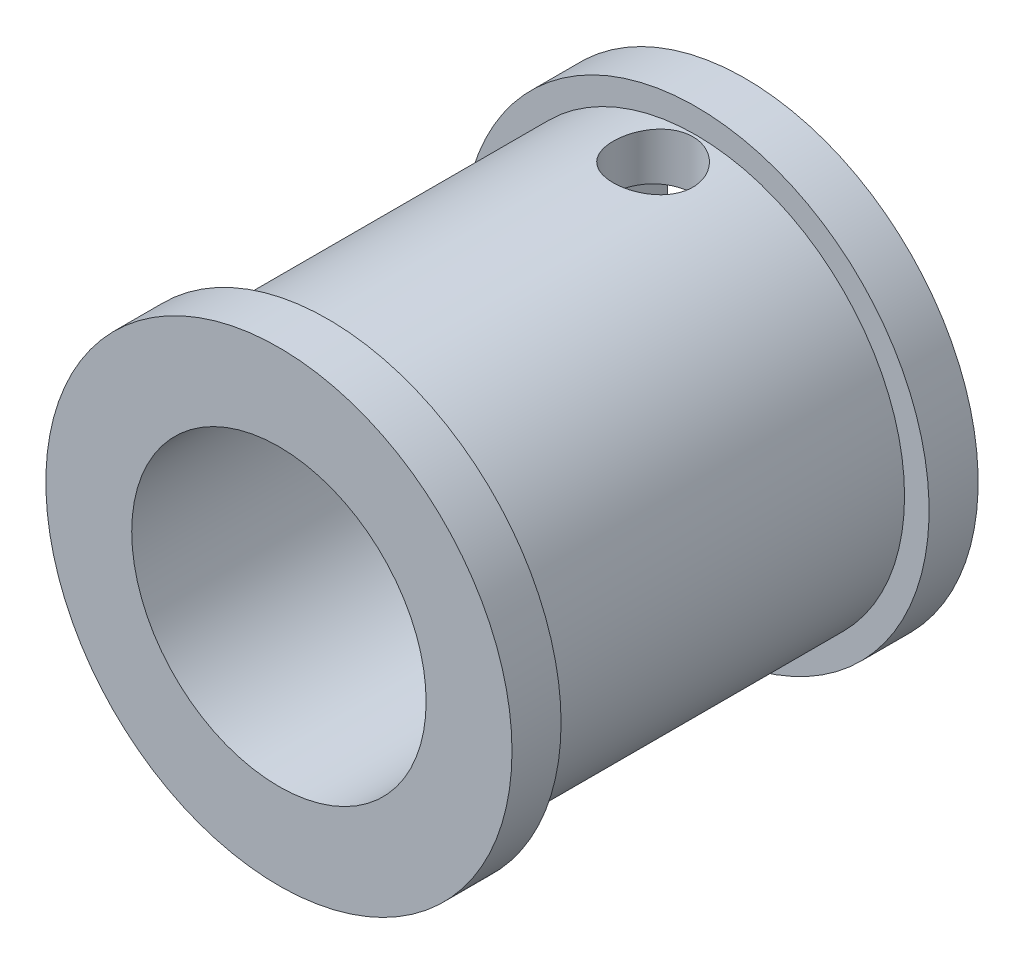
ISO-10303-21;
HEADER;
FILE_DESCRIPTION(('STEP AP214'),'2;1');
FILE_NAME('part.step','',(''),(''),'','','');
FILE_SCHEMA(('AUTOMOTIVE_DESIGN { 1 0 10303 214 1 1 1 1 }'));
ENDSEC;
DATA;
#1=APPLICATION_CONTEXT('core data for automotive mechanical design processes');
#2=APPLICATION_PROTOCOL_DEFINITION('international standard','automotive_design',2000,#1);
#3=PRODUCT_CONTEXT('',#1,'mechanical');
#4=PRODUCT('Part','Part','',(#3));
#5=PRODUCT_RELATED_PRODUCT_CATEGORY('part','',(#4));
#6=PRODUCT_DEFINITION_FORMATION('','',#4);
#7=PRODUCT_DEFINITION_CONTEXT('part definition',#1,'design');
#8=PRODUCT_DEFINITION('design','',#6,#7);
#9=PRODUCT_DEFINITION_SHAPE('','',#8);
#10=(LENGTH_UNIT() NAMED_UNIT(*) SI_UNIT(.MILLI.,.METRE.));
#11=(NAMED_UNIT(*) PLANE_ANGLE_UNIT() SI_UNIT($,.RADIAN.));
#12=(NAMED_UNIT(*) SI_UNIT($,.STERADIAN.) SOLID_ANGLE_UNIT());
#13=UNCERTAINTY_MEASURE_WITH_UNIT(LENGTH_MEASURE(1.E-05),#10,'distance_accuracy_value','');
#14=(GEOMETRIC_REPRESENTATION_CONTEXT(3) GLOBAL_UNCERTAINTY_ASSIGNED_CONTEXT((#13)) GLOBAL_UNIT_ASSIGNED_CONTEXT((#10,
#11,#12)) REPRESENTATION_CONTEXT('',''));
#15=CARTESIAN_POINT('',(0.,0.,0.));
#16=DIRECTION('',(0.,0.,1.));
#17=DIRECTION('',(1.,0.,0.));
#18=AXIS2_PLACEMENT_3D('',#15,#16,#17);
#19=CARTESIAN_POINT('',(0.,0.,19.));
#20=DIRECTION('',(0.,0.,-1.));
#21=DIRECTION('',(-1.,0.,0.));
#22=AXIS2_PLACEMENT_3D('',#19,#20,#21);
#23=CYLINDRICAL_SURFACE('',#22,1.625);
#24=CARTESIAN_POINT('',(0.,0.,3.75));
#25=DIRECTION('',(0.,-0.707106781186547,-0.707106781186547));
#26=DIRECTION('',(0.,0.707106781186547,-0.707106781186547));
#27=AXIS2_PLACEMENT_3D('',#24,#25,#26);
#28=ELLIPSE('',#27,2.29809703885628,1.625);
#29=CARTESIAN_POINT('',(-1.625,0.,3.75));
#30=VERTEX_POINT('',#29);
#31=CARTESIAN_POINT('',(-1.61264534228701,-0.2,3.95));
#32=VERTEX_POINT('',#31);
#33=EDGE_CURVE('E113',#30,#32,#28,.F.);
#34=ORIENTED_EDGE('',*,*,#33,.F.);
#35=CARTESIAN_POINT('',(0.,0.,3.75));
#36=DIRECTION('',(0.,0.707106781186547,-0.707106781186547));
#37=DIRECTION('',(0.,-0.707106781186547,-0.707106781186547));
#38=AXIS2_PLACEMENT_3D('',#35,#36,#37);
#39=ELLIPSE('',#38,2.29809703885628,1.625);
#40=CARTESIAN_POINT('',(1.625,0.,3.75));
#41=VERTEX_POINT('',#40);
#42=EDGE_CURVE('E109',#41,#30,#39,.F.);
#43=ORIENTED_EDGE('',*,*,#42,.F.);
#44=CARTESIAN_POINT('',(1.61264534228701,-0.2,3.95));
#45=VERTEX_POINT('',#44);
#46=EDGE_CURVE('E101',#45,#41,#28,.F.);
#47=ORIENTED_EDGE('',*,*,#46,.F.);
#48=DIRECTION('',(0.,0.,-1.));
#49=VECTOR('',#48,1.);
#50=CARTESIAN_POINT('',(1.61264534228701,-0.2,19.));
#51=LINE('',#50,#49);
#52=CARTESIAN_POINT('',(1.61264534228701,-0.2,3.55));
#53=VERTEX_POINT('',#52);
#54=EDGE_CURVE('E42',#45,#53,#51,.T.);
#55=ORIENTED_EDGE('',*,*,#54,.T.);
#56=CARTESIAN_POINT('',(0.,0.,3.75));
#57=DIRECTION('',(0.,0.707106781186547,-0.707106781186547));
#58=DIRECTION('',(0.,-0.707106781186547,-0.707106781186547));
#59=AXIS2_PLACEMENT_3D('',#56,#57,#58);
#60=ELLIPSE('',#59,2.29809703885628,1.625);
#61=EDGE_CURVE('E103',#41,#53,#60,.T.);
#62=ORIENTED_EDGE('',*,*,#61,.F.);
#63=CARTESIAN_POINT('',(0.,0.,3.75));
#64=DIRECTION('',(0.,-0.707106781186547,-0.707106781186547));
#65=DIRECTION('',(0.,0.707106781186547,-0.707106781186547));
#66=AXIS2_PLACEMENT_3D('',#63,#64,#65);
#67=ELLIPSE('',#66,2.29809703885628,1.625);
#68=EDGE_CURVE('E110',#30,#41,#67,.T.);
#69=ORIENTED_EDGE('',*,*,#68,.F.);
#70=CARTESIAN_POINT('',(-1.61264534228701,-0.2,3.55));
#71=VERTEX_POINT('',#70);
#72=EDGE_CURVE('E49',#71,#30,#60,.T.);
#73=ORIENTED_EDGE('',*,*,#72,.F.);
#74=DIRECTION('',(0.,0.,-1.));
#75=VECTOR('',#74,1.);
#76=CARTESIAN_POINT('',(-1.61264534228701,-0.2,19.));
#77=LINE('',#76,#75);
#78=EDGE_CURVE('E11',#71,#32,#77,.F.);
#79=ORIENTED_EDGE('',*,*,#78,.T.);
#80=EDGE_LOOP('',(#34,#43,#47,#55,#62,#69,#73,#79));
#81=FACE_BOUND('',#80,.T.);
#82=CARTESIAN_POINT('',(0.,0.,0.));
#83=DIRECTION('',(0.,0.,1.));
#84=DIRECTION('',(1.,0.,0.));
#85=AXIS2_PLACEMENT_3D('',#82,#83,#84);
#86=CIRCLE('',#85,1.625);
#87=CARTESIAN_POINT('',(1.625,0.,0.));
#88=VERTEX_POINT('',#87);
#89=EDGE_CURVE('E199',#88,#88,#86,.T.);
#90=ORIENTED_EDGE('',*,*,#89,.F.);
#91=EDGE_LOOP('',(#90));
#92=FACE_BOUND('',#91,.T.);
#93=CARTESIAN_POINT('',(0.,0.,10.));
#94=DIRECTION('',(0.,0.,1.));
#95=DIRECTION('',(1.,0.,0.));
#96=AXIS2_PLACEMENT_3D('',#93,#94,#95);
#97=CIRCLE('',#96,1.625);
#98=CARTESIAN_POINT('',(1.625,0.,10.));
#99=VERTEX_POINT('',#98);
#100=EDGE_CURVE('E37',#99,#99,#97,.F.);
#101=ORIENTED_EDGE('',*,*,#100,.F.);
#102=EDGE_LOOP('',(#101));
#103=FACE_BOUND('',#102,.T.);
#104=ADVANCED_FACE('F32',(#81,#92,#103),#23,.F.);
#105=CARTESIAN_POINT('',(0.,0.,19.));
#106=DIRECTION('',(0.,0.,-1.));
#107=DIRECTION('',(-1.,0.,0.));
#108=AXIS2_PLACEMENT_3D('',#105,#106,#107);
#109=CYLINDRICAL_SURFACE('',#108,8.5);
#110=CARTESIAN_POINT('',(0.,0.,2.));
#111=DIRECTION('',(0.,0.,-1.));
#112=DIRECTION('',(-1.,0.,0.));
#113=AXIS2_PLACEMENT_3D('',#110,#111,#112);
#114=CIRCLE('',#113,8.5);
#115=CARTESIAN_POINT('',(-8.5,0.,2.));
#116=VERTEX_POINT('',#115);
#117=EDGE_CURVE('E241',#116,#116,#114,.T.);
#118=ORIENTED_EDGE('',*,*,#117,.F.);
#119=EDGE_LOOP('',(#118));
#120=FACE_BOUND('',#119,.T.);
#121=CARTESIAN_POINT('',(0.,0.,17.));
#122=DIRECTION('',(0.,0.,1.));
#123=DIRECTION('',(1.,0.,0.));
#124=AXIS2_PLACEMENT_3D('',#121,#122,#123);
#125=CIRCLE('',#124,8.5);
#126=CARTESIAN_POINT('',(8.5,0.,17.));
#127=VERTEX_POINT('',#126);
#128=EDGE_CURVE('E96',#127,#127,#125,.T.);
#129=ORIENTED_EDGE('',*,*,#128,.F.);
#130=EDGE_LOOP('',(#129));
#131=FACE_BOUND('',#130,.T.);
#132=CARTESIAN_POINT('',(0.,8.5,5.375));
#133=CARTESIAN_POINT('',(0.0903945572538876,8.49999835243109,5.37499658149126));
#134=CARTESIAN_POINT('',(0.18083322350035,8.49854316497424,5.36743188876263));
#135=CARTESIAN_POINT('',(0.359159795109496,8.49287842275933,5.33739377851433));
#136=CARTESIAN_POINT('',(0.447045520844813,8.48866658268262,5.31490799090195));
#137=CARTESIAN_POINT('',(0.61766163173839,8.47795944255546,5.25574319233837));
#138=CARTESIAN_POINT('',(0.700396673362368,8.47146624131938,5.21907722380532));
#139=CARTESIAN_POINT('',(0.858533605572363,8.45690451266456,5.13263040235962));
#140=CARTESIAN_POINT('',(0.933936043768956,8.44883610302048,5.08285052984576));
#141=CARTESIAN_POINT('',(1.0762115101766,8.43190166548817,4.97093250788181));
#142=CARTESIAN_POINT('',(1.14298024738396,8.42302775850568,4.90866295749279));
#143=CARTESIAN_POINT('',(1.265190534391,8.40554061471071,4.77381579060993));
#144=CARTESIAN_POINT('',(1.32063125056873,8.3969273971219,4.70123741616192));
#145=CARTESIAN_POINT('',(1.41904843072196,8.3808601674157,4.5470920108507));
#146=CARTESIAN_POINT('',(1.4619182579635,8.37341630821173,4.46545574409331));
#147=CARTESIAN_POINT('',(1.53329395239523,8.36064189133733,4.29597353068678));
#148=CARTESIAN_POINT('',(1.56180110980798,8.35531114385172,4.20812814262207));
#149=CARTESIAN_POINT('',(1.60330642854418,8.34744594074392,4.02983899567812));
#150=CARTESIAN_POINT('',(1.61648678881636,8.34487866196381,3.93943912923692));
#151=CARTESIAN_POINT('',(1.62753001967958,8.3427321608315,3.75767745170205));
#152=CARTESIAN_POINT('',(1.62539431903934,8.34315265976247,3.66631573112951));
#153=CARTESIAN_POINT('',(1.60601366876019,8.34690433687137,3.48654750599075));
#154=CARTESIAN_POINT('',(1.58897638350366,8.35019550841473,3.39811765472527));
#155=CARTESIAN_POINT('',(1.54060344594839,8.35925481483431,3.22539498587627));
#156=CARTESIAN_POINT('',(1.50926716430382,8.36502305873398,3.1411023505661));
#157=CARTESIAN_POINT('',(1.43298405267585,8.37842813084279,2.97844189309478));
#158=CARTESIAN_POINT('',(1.38795381514222,8.38607635335706,2.90011416452897));
#159=CARTESIAN_POINT('',(1.2856199831973,8.40237214993443,2.75204841155908));
#160=CARTESIAN_POINT('',(1.22831509557011,8.4110198292527,2.68231129345321));
#161=CARTESIAN_POINT('',(1.10194123988146,8.42851419579409,2.55220695777682));
#162=CARTESIAN_POINT('',(1.03269475902188,8.43736182091324,2.49201215670377));
#163=CARTESIAN_POINT('',(0.88499618103328,8.45412897950981,2.38406683487531));
#164=CARTESIAN_POINT('',(0.806543984550195,8.46204850296872,2.33631644844601));
#165=CARTESIAN_POINT('',(0.642477737724025,8.47608409888518,2.25458814921088));
#166=CARTESIAN_POINT('',(0.556854280078011,8.48219775328289,2.22062867986473));
#167=CARTESIAN_POINT('',(0.38097510574662,8.49191418361371,2.16762325135386));
#168=CARTESIAN_POINT('',(0.290719902135103,8.49551723701261,2.14857564413613));
#169=CARTESIAN_POINT('',(0.109622114135444,8.49976823391624,2.1261758014087));
#170=CARTESIAN_POINT('',(0.018809749828459,8.50046063654033,2.12258741077682));
#171=CARTESIAN_POINT('',(-0.162117246503742,8.49893532218348,2.13057367090997));
#172=CARTESIAN_POINT('',(-0.25223191398799,8.49671775408556,2.14214754592698));
#173=CARTESIAN_POINT('',(-0.428452755980503,8.48964939137328,2.17993349679757));
#174=CARTESIAN_POINT('',(-0.514585598146657,8.48482018812363,2.20602559546225));
#175=CARTESIAN_POINT('',(-0.681254067551567,8.47306787307943,2.2719771354861));
#176=CARTESIAN_POINT('',(-0.761789302684263,8.46614461478012,2.31183754013441));
#177=CARTESIAN_POINT('',(-0.915980891342013,8.45086126981745,2.40471348330283));
#178=CARTESIAN_POINT('',(-0.989549140397992,8.44248581784409,2.45787271121178));
#179=CARTESIAN_POINT('',(-1.12680563036966,8.42526573618666,2.5756434586076));
#180=CARTESIAN_POINT('',(-1.19049290845354,8.4164210608926,2.64025609283648));
#181=CARTESIAN_POINT('',(-1.30708102478181,8.399111203794,2.78017039825303));
#182=CARTESIAN_POINT('',(-1.35982041980168,8.3906529663421,2.85560760098976));
#183=CARTESIAN_POINT('',(-1.45187917952133,8.37521549819557,3.01440915883489));
#184=CARTESIAN_POINT('',(-1.49119905477389,8.36823621123733,3.09777321220771));
#185=CARTESIAN_POINT('',(-1.55507616817908,8.35660182144951,3.2696600189125));
#186=CARTESIAN_POINT('',(-1.57970620665021,8.35193527686773,3.35815490709934));
#187=CARTESIAN_POINT('',(-1.61372797970122,8.34542912956261,3.53812487793951));
#188=CARTESIAN_POINT('',(-1.62312150978107,8.3435891937475,3.62959960814628));
#189=CARTESIAN_POINT('',(-1.62634169273169,8.34296194602857,3.81131443308119));
#190=CARTESIAN_POINT('',(-1.62042313014401,8.34412467096553,3.90154993808799));
#191=CARTESIAN_POINT('',(-1.59374624145851,8.34926070378568,4.07971428316511));
#192=CARTESIAN_POINT('',(-1.57298801248506,8.35323399327397,4.16764313832837));
#193=CARTESIAN_POINT('',(-1.51733033383493,8.36352204818264,4.33855393284873));
#194=CARTESIAN_POINT('',(-1.4824595280227,8.36983206862051,4.4215455042208));
#195=CARTESIAN_POINT('',(-1.39959479949044,8.38408576757389,4.58054066291797));
#196=CARTESIAN_POINT('',(-1.35159989918565,8.39202956777509,4.656543729121));
#197=CARTESIAN_POINT('',(-1.2429680791682,8.40881021672979,4.80067852256959));
#198=CARTESIAN_POINT('',(-1.18214614064919,8.41765903391513,4.86866943540694));
#199=CARTESIAN_POINT('',(-1.04997148708861,8.4351641981668,4.99356486630231));
#200=CARTESIAN_POINT('',(-0.978616356463049,8.44382050055824,5.05046683436179));
#201=CARTESIAN_POINT('',(-0.826595057873993,8.46006107011932,5.15207132625573));
#202=CARTESIAN_POINT('',(-0.745847538817393,8.46763447478637,5.19665392716147));
#203=CARTESIAN_POINT('',(-0.577888066767615,8.48074963995798,5.27154823399553));
#204=CARTESIAN_POINT('',(-0.490682202958104,8.48629328560504,5.30187318921524));
#205=CARTESIAN_POINT('',(-0.336030835981106,8.49360936379373,5.34131559546969));
#206=CARTESIAN_POINT('',(-0.269482836608206,8.49599217795871,5.35392539301356));
#207=CARTESIAN_POINT('',(-0.135298109376888,8.49918809133807,5.37076876082237));
#208=CARTESIAN_POINT('',(-0.067661411165921,8.50000123322511,5.37500255879483));
#209=CARTESIAN_POINT('',(0.,8.5,5.375));
#210=B_SPLINE_CURVE_WITH_KNOTS('',3,(#132,#133,#134,#135,#136,#137,#138,#139,#140,#141,#142,
#143,#144,#145,#146,#147,#148,#149,#150,#151,#152,#153,#154,#155,#156,#157,#158,#159,#160,#161,
#162,#163,#164,#165,#166,#167,#168,#169,#170,#171,#172,#173,#174,#175,#176,#177,#178,#179,#180,
#181,#182,#183,#184,#185,#186,#187,#188,#189,#190,#191,#192,#193,#194,#195,#196,#197,#198,#199,
#200,#201,#202,#203,#204,#205,#206,#207,#208,#209),.UNSPECIFIED.,.T.,.F.,(4,2,2,2,2,2,2,2,2,2,2,
2,2,2,2,2,2,2,2,2,2,2,2,2,2,2,2,2,2,2,2,2,2,2,2,2,2,2,4),(0.,0.270936205781262,
0.542097307937282,0.813009596787944,1.08390163791212,1.35780918645762,1.63173688443393,
1.9079251660624,2.1840886328117,2.45693448620097,2.72975488731821,2.99883284967365,
3.26792265617709,3.53868543374998,3.80947675202337,4.08470890002385,4.35994401878148,
4.63554602407514,4.91111756564415,5.18246420466136,5.45379696129436,5.7229200562965,
5.99206198410815,6.26424798646523,6.53646049481757,6.8124395539943,7.08840811222947,
7.36299740133278,7.63755432994534,7.90757227899994,8.1775884608257,8.44705932581407,
8.71655026856117,8.99023277903381,9.26397815108827,9.54030127403387,9.81636710644622,
10.0191716221483,10.2219706243892),.UNSPECIFIED.);
#211=CARTESIAN_POINT('',(0.,8.5,5.375));
#212=VERTEX_POINT('',#211);
#213=EDGE_CURVE('E120',#212,#212,#210,.T.);
#214=ORIENTED_EDGE('',*,*,#213,.F.);
#215=EDGE_LOOP('',(#214));
#216=FACE_BOUND('',#215,.T.);
#217=ADVANCED_FACE('F34',(#120,#131,#216),#109,.T.);
#218=CARTESIAN_POINT('',(0.,0.,19.));
#219=DIRECTION('',(0.,0.,1.));
#220=DIRECTION('',(1.,0.,0.));
#221=AXIS2_PLACEMENT_3D('',#218,#219,#220);
#222=PLANE('',#221);
#223=CARTESIAN_POINT('',(0.,0.,19.));
#224=DIRECTION('',(0.,0.,1.));
#225=DIRECTION('',(1.,0.,0.));
#226=AXIS2_PLACEMENT_3D('',#223,#224,#225);
#227=CIRCLE('',#226,6.);
#228=CARTESIAN_POINT('',(6.,0.,19.));
#229=VERTEX_POINT('',#228);
#230=EDGE_CURVE('E310',#229,#229,#227,.T.);
#231=ORIENTED_EDGE('',*,*,#230,.F.);
#232=EDGE_LOOP('',(#231));
#233=FACE_BOUND('',#232,.T.);
#234=CARTESIAN_POINT('',(0.,0.,19.));
#235=DIRECTION('',(0.,0.,1.));
#236=DIRECTION('',(1.,0.,0.));
#237=AXIS2_PLACEMENT_3D('',#234,#235,#236);
#238=CIRCLE('',#237,9.5);
#239=CARTESIAN_POINT('',(9.5,0.,19.));
#240=VERTEX_POINT('',#239);
#241=EDGE_CURVE('E122',#240,#240,#238,.T.);
#242=ORIENTED_EDGE('',*,*,#241,.T.);
#243=EDGE_LOOP('',(#242));
#244=FACE_BOUND('',#243,.T.);
#245=ADVANCED_FACE('F183',(#233,#244),#222,.T.);
#246=CARTESIAN_POINT('',(0.,0.,0.));
#247=DIRECTION('',(0.,0.,1.));
#248=DIRECTION('',(1.,0.,0.));
#249=AXIS2_PLACEMENT_3D('',#246,#247,#248);
#250=PLANE('',#249);
#251=DIRECTION('',(1.,0.,0.));
#252=VECTOR('',#251,1.);
#253=CARTESIAN_POINT('',(3.17,6.5,0.));
#254=LINE('',#253,#252);
#255=CARTESIAN_POINT('',(-3.17,6.5,0.));
#256=VERTEX_POINT('',#255);
#257=CARTESIAN_POINT('',(3.17,6.5,0.));
#258=VERTEX_POINT('',#257);
#259=EDGE_CURVE('E195',#256,#258,#254,.T.);
#260=ORIENTED_EDGE('',*,*,#259,.F.);
#261=DIRECTION('',(0.,1.,0.));
#262=VECTOR('',#261,1.);
#263=CARTESIAN_POINT('',(-3.17,3.5,0.));
#264=LINE('',#263,#262);
#265=CARTESIAN_POINT('',(-3.17,3.5,0.));
#266=VERTEX_POINT('',#265);
#267=EDGE_CURVE('E207',#266,#256,#264,.T.);
#268=ORIENTED_EDGE('',*,*,#267,.F.);
#269=DIRECTION('',(-1.,0.,0.));
#270=VECTOR('',#269,1.);
#271=CARTESIAN_POINT('',(3.17,3.5,0.));
#272=LINE('',#271,#270);
#273=CARTESIAN_POINT('',(3.17,3.5,0.));
#274=VERTEX_POINT('',#273);
#275=EDGE_CURVE('E215',#274,#266,#272,.T.);
#276=ORIENTED_EDGE('',*,*,#275,.F.);
#277=DIRECTION('',(0.,-1.,0.));
#278=VECTOR('',#277,1.);
#279=CARTESIAN_POINT('',(3.17,3.5,0.));
#280=LINE('',#279,#278);
#281=EDGE_CURVE('E227',#258,#274,#280,.T.);
#282=ORIENTED_EDGE('',*,*,#281,.F.);
#283=EDGE_LOOP('',(#260,#268,#276,#282));
#284=FACE_BOUND('',#283,.T.);
#285=ORIENTED_EDGE('',*,*,#89,.T.);
#286=EDGE_LOOP('',(#285));
#287=FACE_BOUND('',#286,.T.);
#288=CARTESIAN_POINT('',(0.,0.,0.));
#289=DIRECTION('',(0.,0.,-1.));
#290=DIRECTION('',(-1.,0.,0.));
#291=AXIS2_PLACEMENT_3D('',#288,#289,#290);
#292=CIRCLE('',#291,9.5);
#293=CARTESIAN_POINT('',(-9.5,0.,0.));
#294=VERTEX_POINT('',#293);
#295=EDGE_CURVE('E202',#294,#294,#292,.T.);
#296=ORIENTED_EDGE('',*,*,#295,.T.);
#297=EDGE_LOOP('',(#296));
#298=FACE_BOUND('',#297,.T.);
#299=ADVANCED_FACE('F179',(#284,#287,#298),#250,.F.);
#300=CARTESIAN_POINT('',(-3.17,3.5,7.5));
#301=DIRECTION('',(-1.,0.,0.));
#302=DIRECTION('',(0.,0.,1.));
#303=AXIS2_PLACEMENT_3D('',#300,#301,#302);
#304=PLANE('',#303);
#305=ORIENTED_EDGE('',*,*,#267,.T.);
#306=DIRECTION('',(0.,0.,-1.));
#307=VECTOR('',#306,1.);
#308=CARTESIAN_POINT('',(-3.17,6.5,7.5));
#309=LINE('',#308,#307);
#310=CARTESIAN_POINT('',(-3.17,6.5,7.5));
#311=VERTEX_POINT('',#310);
#312=EDGE_CURVE('E224',#311,#256,#309,.T.);
#313=ORIENTED_EDGE('',*,*,#312,.F.);
#314=DIRECTION('',(0.,1.,0.));
#315=VECTOR('',#314,1.);
#316=CARTESIAN_POINT('',(-3.17,3.5,7.5));
#317=LINE('',#316,#315);
#318=CARTESIAN_POINT('',(-3.17,3.5,7.5));
#319=VERTEX_POINT('',#318);
#320=EDGE_CURVE('E211',#319,#311,#317,.T.);
#321=ORIENTED_EDGE('',*,*,#320,.F.);
#322=DIRECTION('',(0.,0.,-1.));
#323=VECTOR('',#322,1.);
#324=CARTESIAN_POINT('',(-3.17,3.5,7.5));
#325=LINE('',#324,#323);
#326=EDGE_CURVE('E232',#319,#266,#325,.T.);
#327=ORIENTED_EDGE('',*,*,#326,.T.);
#328=EDGE_LOOP('',(#305,#313,#321,#327));
#329=FACE_BOUND('',#328,.T.);
#330=ADVANCED_FACE('F169',(#329),#304,.F.);
#331=CARTESIAN_POINT('',(3.17,3.5,7.5));
#332=DIRECTION('',(0.,-1.,0.));
#333=DIRECTION('',(0.,0.,-1.));
#334=AXIS2_PLACEMENT_3D('',#331,#332,#333);
#335=PLANE('',#334);
#336=CARTESIAN_POINT('',(0.,3.5,3.75));
#337=DIRECTION('',(0.,-1.,0.));
#338=DIRECTION('',(0.,0.,-1.));
#339=AXIS2_PLACEMENT_3D('',#336,#337,#338);
#340=CIRCLE('',#339,1.625);
#341=CARTESIAN_POINT('',(0.,3.5,2.125));
#342=VERTEX_POINT('',#341);
#343=EDGE_CURVE('E111',#342,#342,#340,.F.);
#344=ORIENTED_EDGE('',*,*,#343,.F.);
#345=EDGE_LOOP('',(#344));
#346=FACE_BOUND('',#345,.T.);
#347=ORIENTED_EDGE('',*,*,#275,.T.);
#348=ORIENTED_EDGE('',*,*,#326,.F.);
#349=DIRECTION('',(-1.,0.,0.));
#350=VECTOR('',#349,1.);
#351=CARTESIAN_POINT('',(3.17,3.5,7.5));
#352=LINE('',#351,#350);
#353=CARTESIAN_POINT('',(3.17,3.5,7.5));
#354=VERTEX_POINT('',#353);
#355=EDGE_CURVE('E221',#354,#319,#352,.T.);
#356=ORIENTED_EDGE('',*,*,#355,.F.);
#357=DIRECTION('',(0.,0.,-1.));
#358=VECTOR('',#357,1.);
#359=CARTESIAN_POINT('',(3.17,3.5,7.5));
#360=LINE('',#359,#358);
#361=EDGE_CURVE('E234',#354,#274,#360,.T.);
#362=ORIENTED_EDGE('',*,*,#361,.T.);
#363=EDGE_LOOP('',(#347,#348,#356,#362));
#364=FACE_BOUND('',#363,.T.);
#365=ADVANCED_FACE('F165',(#346,#364),#335,.F.);
#366=CARTESIAN_POINT('',(3.17,3.5,7.5));
#367=DIRECTION('',(1.,0.,0.));
#368=DIRECTION('',(0.,0.,-1.));
#369=AXIS2_PLACEMENT_3D('',#366,#367,#368);
#370=PLANE('',#369);
#371=ORIENTED_EDGE('',*,*,#281,.T.);
#372=ORIENTED_EDGE('',*,*,#361,.F.);
#373=DIRECTION('',(0.,-1.,0.));
#374=VECTOR('',#373,1.);
#375=CARTESIAN_POINT('',(3.17,3.5,7.5));
#376=LINE('',#375,#374);
#377=CARTESIAN_POINT('',(3.17,6.5,7.5));
#378=VERTEX_POINT('',#377);
#379=EDGE_CURVE('E218',#378,#354,#376,.T.);
#380=ORIENTED_EDGE('',*,*,#379,.F.);
#381=DIRECTION('',(0.,0.,-1.));
#382=VECTOR('',#381,1.);
#383=CARTESIAN_POINT('',(3.17,6.5,7.5));
#384=LINE('',#383,#382);
#385=EDGE_CURVE('E236',#378,#258,#384,.T.);
#386=ORIENTED_EDGE('',*,*,#385,.T.);
#387=EDGE_LOOP('',(#371,#372,#380,#386));
#388=FACE_BOUND('',#387,.T.);
#389=ADVANCED_FACE('F168',(#388),#370,.F.);
#390=CARTESIAN_POINT('',(3.17,6.5,7.5));
#391=DIRECTION('',(0.,1.,0.));
#392=DIRECTION('',(0.,0.,1.));
#393=AXIS2_PLACEMENT_3D('',#390,#391,#392);
#394=PLANE('',#393);
#395=CARTESIAN_POINT('',(0.,6.5,3.75));
#396=DIRECTION('',(0.,1.,0.));
#397=DIRECTION('',(0.,0.,1.));
#398=AXIS2_PLACEMENT_3D('',#395,#396,#397);
#399=CIRCLE('',#398,1.625);
#400=CARTESIAN_POINT('',(0.,6.5,5.375));
#401=VERTEX_POINT('',#400);
#402=EDGE_CURVE('E104',#401,#401,#399,.F.);
#403=ORIENTED_EDGE('',*,*,#402,.F.);
#404=EDGE_LOOP('',(#403));
#405=FACE_BOUND('',#404,.T.);
#406=ORIENTED_EDGE('',*,*,#259,.T.);
#407=ORIENTED_EDGE('',*,*,#385,.F.);
#408=DIRECTION('',(1.,0.,0.));
#409=VECTOR('',#408,1.);
#410=CARTESIAN_POINT('',(3.17,6.5,7.5));
#411=LINE('',#410,#409);
#412=EDGE_CURVE('E214',#311,#378,#411,.T.);
#413=ORIENTED_EDGE('',*,*,#412,.F.);
#414=ORIENTED_EDGE('',*,*,#312,.T.);
#415=EDGE_LOOP('',(#406,#407,#413,#414));
#416=FACE_BOUND('',#415,.T.);
#417=ADVANCED_FACE('F163',(#405,#416),#394,.F.);
#418=CARTESIAN_POINT('',(0.,0.,7.5));
#419=DIRECTION('',(0.,0.,1.));
#420=DIRECTION('',(1.,0.,0.));
#421=AXIS2_PLACEMENT_3D('',#418,#419,#420);
#422=PLANE('',#421);
#423=ORIENTED_EDGE('',*,*,#320,.T.);
#424=ORIENTED_EDGE('',*,*,#412,.T.);
#425=ORIENTED_EDGE('',*,*,#379,.T.);
#426=ORIENTED_EDGE('',*,*,#355,.T.);
#427=EDGE_LOOP('',(#423,#424,#425,#426));
#428=FACE_BOUND('',#427,.T.);
#429=ADVANCED_FACE('F159',(#428),#422,.F.);
#430=CARTESIAN_POINT('',(0.,0.,2.));
#431=DIRECTION('',(0.,0.,-1.));
#432=DIRECTION('',(-1.,0.,0.));
#433=AXIS2_PLACEMENT_3D('',#430,#431,#432);
#434=CYLINDRICAL_SURFACE('',#433,9.5);
#435=CARTESIAN_POINT('',(0.,0.,2.));
#436=DIRECTION('',(0.,0.,-1.));
#437=DIRECTION('',(-1.,0.,0.));
#438=AXIS2_PLACEMENT_3D('',#435,#436,#437);
#439=CIRCLE('',#438,9.5);
#440=CARTESIAN_POINT('',(-9.5,0.,2.));
#441=VERTEX_POINT('',#440);
#442=EDGE_CURVE('E204',#441,#441,#439,.T.);
#443=ORIENTED_EDGE('',*,*,#442,.T.);
#444=EDGE_LOOP('',(#443));
#445=FACE_BOUND('',#444,.T.);
#446=ORIENTED_EDGE('',*,*,#295,.F.);
#447=EDGE_LOOP('',(#446));
#448=FACE_BOUND('',#447,.T.);
#449=ADVANCED_FACE('F155',(#445,#448),#434,.T.);
#450=CARTESIAN_POINT('',(0.,0.,2.));
#451=DIRECTION('',(0.,0.,-1.));
#452=DIRECTION('',(-1.,0.,0.));
#453=AXIS2_PLACEMENT_3D('',#450,#451,#452);
#454=PLANE('',#453);
#455=ORIENTED_EDGE('',*,*,#117,.T.);
#456=EDGE_LOOP('',(#455));
#457=FACE_BOUND('',#456,.T.);
#458=ORIENTED_EDGE('',*,*,#442,.F.);
#459=EDGE_LOOP('',(#458));
#460=FACE_BOUND('',#459,.T.);
#461=ADVANCED_FACE('F151',(#457,#460),#454,.F.);
#462=CARTESIAN_POINT('',(0.,0.,17.));
#463=DIRECTION('',(0.,0.,1.));
#464=DIRECTION('',(1.,0.,0.));
#465=AXIS2_PLACEMENT_3D('',#462,#463,#464);
#466=CYLINDRICAL_SURFACE('',#465,9.5);
#467=CARTESIAN_POINT('',(0.,0.,17.));
#468=DIRECTION('',(0.,0.,1.));
#469=DIRECTION('',(1.,0.,0.));
#470=AXIS2_PLACEMENT_3D('',#467,#468,#469);
#471=CIRCLE('',#470,9.5);
#472=CARTESIAN_POINT('',(9.5,0.,17.));
#473=VERTEX_POINT('',#472);
#474=EDGE_CURVE('E127',#473,#473,#471,.T.);
#475=ORIENTED_EDGE('',*,*,#474,.T.);
#476=EDGE_LOOP('',(#475));
#477=FACE_BOUND('',#476,.T.);
#478=ORIENTED_EDGE('',*,*,#241,.F.);
#479=EDGE_LOOP('',(#478));
#480=FACE_BOUND('',#479,.T.);
#481=ADVANCED_FACE('F147',(#477,#480),#466,.T.);
#482=CARTESIAN_POINT('',(0.,0.,17.));
#483=DIRECTION('',(0.,0.,1.));
#484=DIRECTION('',(1.,0.,0.));
#485=AXIS2_PLACEMENT_3D('',#482,#483,#484);
#486=PLANE('',#485);
#487=ORIENTED_EDGE('',*,*,#128,.T.);
#488=EDGE_LOOP('',(#487));
#489=FACE_BOUND('',#488,.T.);
#490=ORIENTED_EDGE('',*,*,#474,.F.);
#491=EDGE_LOOP('',(#490));
#492=FACE_BOUND('',#491,.T.);
#493=ADVANCED_FACE('F140',(#489,#492),#486,.F.);
#494=CARTESIAN_POINT('',(0.,-0.2,3.75));
#495=DIRECTION('',(0.,1.,0.));
#496=DIRECTION('',(0.,0.,1.));
#497=AXIS2_PLACEMENT_3D('',#494,#495,#496);
#498=CYLINDRICAL_SURFACE('',#497,1.625);
#499=ORIENTED_EDGE('',*,*,#402,.T.);
#500=EDGE_LOOP('',(#499));
#501=FACE_BOUND('',#500,.T.);
#502=ORIENTED_EDGE('',*,*,#213,.T.);
#503=EDGE_LOOP('',(#502));
#504=FACE_BOUND('',#503,.T.);
#505=ADVANCED_FACE('F134',(#501,#504),#498,.F.);
#506=ORIENTED_EDGE('',*,*,#343,.T.);
#507=EDGE_LOOP('',(#506));
#508=FACE_BOUND('',#507,.T.);
#509=ORIENTED_EDGE('',*,*,#42,.T.);
#510=ORIENTED_EDGE('',*,*,#68,.T.);
#511=EDGE_LOOP('',(#509,#510));
#512=FACE_BOUND('',#511,.T.);
#513=ADVANCED_FACE('F139',(#508,#512),#498,.F.);
#514=CARTESIAN_POINT('',(0.,-0.2,3.75));
#515=DIRECTION('',(0.,-1.,0.));
#516=DIRECTION('',(0.,0.,-1.));
#517=AXIS2_PLACEMENT_3D('',#514,#515,#516);
#518=PLANE('',#517);
#519=CARTESIAN_POINT('',(0.,-0.2,3.75));
#520=DIRECTION('',(0.,-1.,0.));
#521=DIRECTION('',(0.,0.,-1.));
#522=AXIS2_PLACEMENT_3D('',#519,#520,#521);
#523=CIRCLE('',#522,1.625);
#524=EDGE_CURVE('E56',#53,#45,#523,.T.);
#525=ORIENTED_EDGE('',*,*,#524,.F.);
#526=ORIENTED_EDGE('',*,*,#54,.F.);
#527=EDGE_LOOP('',(#525,#526));
#528=FACE_BOUND('',#527,.T.);
#529=ADVANCED_FACE('F92',(#528),#518,.F.);
#530=ORIENTED_EDGE('',*,*,#61,.T.);
#531=ORIENTED_EDGE('',*,*,#524,.T.);
#532=ORIENTED_EDGE('',*,*,#46,.T.);
#533=EDGE_LOOP('',(#530,#531,#532));
#534=FACE_BOUND('',#533,.T.);
#535=ADVANCED_FACE('F100',(#534),#498,.F.);
#536=EDGE_CURVE('E105',#32,#71,#523,.T.);
#537=ORIENTED_EDGE('',*,*,#536,.F.);
#538=ORIENTED_EDGE('',*,*,#78,.F.);
#539=EDGE_LOOP('',(#537,#538));
#540=FACE_BOUND('',#539,.T.);
#541=ADVANCED_FACE('F143',(#540),#518,.F.);
#542=ORIENTED_EDGE('',*,*,#33,.T.);
#543=ORIENTED_EDGE('',*,*,#536,.T.);
#544=ORIENTED_EDGE('',*,*,#72,.T.);
#545=EDGE_LOOP('',(#542,#543,#544));
#546=FACE_BOUND('',#545,.T.);
#547=ADVANCED_FACE('F142',(#546),#498,.F.);
#548=CARTESIAN_POINT('',(0.,0.,10.));
#549=DIRECTION('',(0.,0.,1.));
#550=DIRECTION('',(1.,0.,0.));
#551=AXIS2_PLACEMENT_3D('',#548,#549,#550);
#552=PLANE('',#551);
#553=CARTESIAN_POINT('',(0.,0.,10.));
#554=DIRECTION('',(0.,0.,1.));
#555=DIRECTION('',(1.,0.,0.));
#556=AXIS2_PLACEMENT_3D('',#553,#554,#555);
#557=CIRCLE('',#556,6.);
#558=CARTESIAN_POINT('',(6.,0.,10.));
#559=VERTEX_POINT('',#558);
#560=EDGE_CURVE('E307',#559,#559,#557,.T.);
#561=ORIENTED_EDGE('',*,*,#560,.T.);
#562=EDGE_LOOP('',(#561));
#563=FACE_BOUND('',#562,.T.);
#564=ORIENTED_EDGE('',*,*,#100,.T.);
#565=EDGE_LOOP('',(#564));
#566=FACE_BOUND('',#565,.T.);
#567=ADVANCED_FACE('F285',(#563,#566),#552,.T.);
#568=CARTESIAN_POINT('',(0.,0.,10.));
#569=DIRECTION('',(0.,0.,1.));
#570=DIRECTION('',(1.,0.,0.));
#571=AXIS2_PLACEMENT_3D('',#568,#569,#570);
#572=CYLINDRICAL_SURFACE('',#571,6.);
#573=ORIENTED_EDGE('',*,*,#560,.F.);
#574=EDGE_LOOP('',(#573));
#575=FACE_BOUND('',#574,.T.);
#576=ORIENTED_EDGE('',*,*,#230,.T.);
#577=EDGE_LOOP('',(#576));
#578=FACE_BOUND('',#577,.T.);
#579=ADVANCED_FACE('F290',(#575,#578),#572,.F.);
#580=CLOSED_SHELL('',(#104,#217,#245,#299,#330,#365,#389,#417,#429,#449,#461,#481,#493,#505,
#513,#529,#535,#541,#547,#567,#579));
#581=MANIFOLD_SOLID_BREP('B2',#580);
#582=ADVANCED_BREP_SHAPE_REPRESENTATION('',(#18,#581),#14);
#583=SHAPE_DEFINITION_REPRESENTATION(#9,#582);
ENDSEC;
END-ISO-10303-21;
